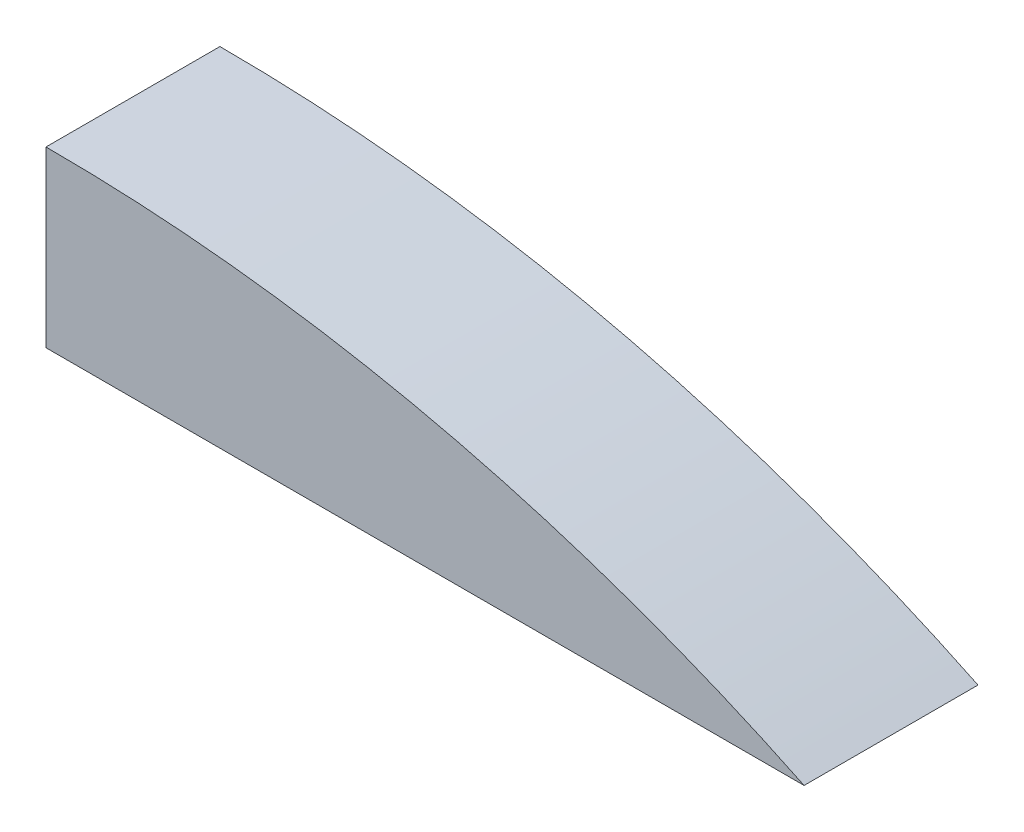
ISO-10303-21;
HEADER;
FILE_DESCRIPTION(('STEP AP214'),'2;1');
FILE_NAME('part.step','',(''),(''),'','','');
FILE_SCHEMA(('AUTOMOTIVE_DESIGN { 1 0 10303 214 1 1 1 1 }'));
ENDSEC;
DATA;
#1=APPLICATION_CONTEXT('core data for automotive mechanical design processes');
#2=APPLICATION_PROTOCOL_DEFINITION('international standard','automotive_design',2000,#1);
#3=PRODUCT_CONTEXT('',#1,'mechanical');
#4=PRODUCT('Part','Part','',(#3));
#5=PRODUCT_RELATED_PRODUCT_CATEGORY('part','',(#4));
#6=PRODUCT_DEFINITION_FORMATION('','',#4);
#7=PRODUCT_DEFINITION_CONTEXT('part definition',#1,'design');
#8=PRODUCT_DEFINITION('design','',#6,#7);
#9=PRODUCT_DEFINITION_SHAPE('','',#8);
#10=(LENGTH_UNIT() NAMED_UNIT(*) SI_UNIT(.MILLI.,.METRE.));
#11=(NAMED_UNIT(*) PLANE_ANGLE_UNIT() SI_UNIT($,.RADIAN.));
#12=(NAMED_UNIT(*) SI_UNIT($,.STERADIAN.) SOLID_ANGLE_UNIT());
#13=UNCERTAINTY_MEASURE_WITH_UNIT(LENGTH_MEASURE(1.E-05),#10,'distance_accuracy_value','');
#14=(GEOMETRIC_REPRESENTATION_CONTEXT(3) GLOBAL_UNCERTAINTY_ASSIGNED_CONTEXT((#13)) GLOBAL_UNIT_ASSIGNED_CONTEXT((#10,
#11,#12)) REPRESENTATION_CONTEXT('',''));
#15=CARTESIAN_POINT('',(0.,0.,0.));
#16=DIRECTION('',(0.,0.,1.));
#17=DIRECTION('',(1.,0.,0.));
#18=AXIS2_PLACEMENT_3D('',#15,#16,#17);
#19=CARTESIAN_POINT('',(0.,45.,0.));
#20=DIRECTION('',(0.,-1.,0.));
#21=DIRECTION('',(0.,0.,-1.));
#22=AXIS2_PLACEMENT_3D('',#19,#20,#21);
#23=PLANE('',#22);
#24=DIRECTION('',(0.,0.,-1.));
#25=VECTOR('',#24,1.);
#26=CARTESIAN_POINT('',(597.266258042068,45.,0.));
#27=LINE('',#26,#25);
#28=CARTESIAN_POINT('',(597.266258042068,45.,5.));
#29=VERTEX_POINT('',#28);
#30=CARTESIAN_POINT('',(597.266258042068,45.,0.));
#31=VERTEX_POINT('',#30);
#32=EDGE_CURVE('E74',#29,#31,#27,.T.);
#33=ORIENTED_EDGE('',*,*,#32,.T.);
#34=DIRECTION('',(1.,0.,0.));
#35=VECTOR('',#34,1.);
#36=CARTESIAN_POINT('',(-502.733741957931,45.,0.));
#37=LINE('',#36,#35);
#38=CARTESIAN_POINT('',(619.060752759772,45.,0.));
#39=VERTEX_POINT('',#38);
#40=EDGE_CURVE('E79',#31,#39,#37,.T.);
#41=ORIENTED_EDGE('',*,*,#40,.T.);
#42=DIRECTION('',(0.,0.,-1.));
#43=VECTOR('',#42,1.);
#44=CARTESIAN_POINT('',(619.060752759772,45.,80.));
#45=LINE('',#44,#43);
#46=CARTESIAN_POINT('',(619.060752759772,45.,5.));
#47=VERTEX_POINT('',#46);
#48=EDGE_CURVE('E83',#39,#47,#45,.F.);
#49=ORIENTED_EDGE('',*,*,#48,.T.);
#50=DIRECTION('',(1.,0.,0.));
#51=VECTOR('',#50,1.);
#52=CARTESIAN_POINT('',(597.266258042068,45.,5.));
#53=LINE('',#52,#51);
#54=EDGE_CURVE('E38',#29,#47,#53,.T.);
#55=ORIENTED_EDGE('',*,*,#54,.F.);
#56=EDGE_LOOP('',(#33,#41,#49,#55));
#57=FACE_BOUND('',#56,.T.);
#58=ADVANCED_FACE('F34',(#57),#23,.T.);
#59=CARTESIAN_POINT('',(-502.733741957931,0.,0.));
#60=DIRECTION('',(0.,0.,1.));
#61=DIRECTION('',(1.,0.,0.));
#62=AXIS2_PLACEMENT_3D('',#59,#60,#61);
#63=PLANE('',#62);
#64=ORIENTED_EDGE('',*,*,#40,.F.);
#65=DIRECTION('',(0.,-1.,0.));
#66=VECTOR('',#65,1.);
#67=CARTESIAN_POINT('',(597.266258042068,0.,0.));
#68=LINE('',#67,#66);
#69=CARTESIAN_POINT('',(597.266258042068,50.,0.));
#70=VERTEX_POINT('',#69);
#71=EDGE_CURVE('E43',#70,#31,#68,.T.);
#72=ORIENTED_EDGE('',*,*,#71,.F.);
#73=CARTESIAN_POINT('',(597.266258042068,0.,0.));
#74=DIRECTION('',(0.,0.,1.));
#75=DIRECTION('',(1.,0.,0.));
#76=AXIS2_PLACEMENT_3D('',#73,#74,#75);
#77=CIRCLE('',#76,50.);
#78=EDGE_CURVE('E59',#39,#70,#77,.T.);
#79=ORIENTED_EDGE('',*,*,#78,.F.);
#80=EDGE_LOOP('',(#64,#72,#79));
#81=FACE_BOUND('',#80,.T.);
#82=ADVANCED_FACE('F80',(#81),#63,.F.);
#83=CARTESIAN_POINT('',(597.266258042068,0.,80.));
#84=DIRECTION('',(0.,0.,-1.));
#85=DIRECTION('',(-1.,0.,0.));
#86=AXIS2_PLACEMENT_3D('',#83,#84,#85);
#87=CYLINDRICAL_SURFACE('',#86,50.);
#88=ORIENTED_EDGE('',*,*,#48,.F.);
#89=ORIENTED_EDGE('',*,*,#78,.T.);
#90=DIRECTION('',(0.,0.,-1.));
#91=VECTOR('',#90,1.);
#92=CARTESIAN_POINT('',(597.266258042068,50.,80.));
#93=LINE('',#92,#91);
#94=CARTESIAN_POINT('',(597.266258042068,50.,5.));
#95=VERTEX_POINT('',#94);
#96=EDGE_CURVE('E11',#95,#70,#93,.T.);
#97=ORIENTED_EDGE('',*,*,#96,.F.);
#98=CARTESIAN_POINT('',(597.266258042068,0.,5.));
#99=DIRECTION('',(0.,0.,1.));
#100=DIRECTION('',(1.,0.,0.));
#101=AXIS2_PLACEMENT_3D('',#98,#99,#100);
#102=CIRCLE('',#101,50.);
#103=EDGE_CURVE('E51',#47,#95,#102,.T.);
#104=ORIENTED_EDGE('',*,*,#103,.F.);
#105=EDGE_LOOP('',(#88,#89,#97,#104));
#106=FACE_BOUND('',#105,.T.);
#107=ADVANCED_FACE('F90',(#106),#87,.T.);
#108=CARTESIAN_POINT('',(597.266258042068,-45.,5.));
#109=DIRECTION('',(0.,0.,1.));
#110=DIRECTION('',(1.,0.,0.));
#111=AXIS2_PLACEMENT_3D('',#108,#109,#110);
#112=PLANE('',#111);
#113=DIRECTION('',(0.,-1.,0.));
#114=VECTOR('',#113,1.);
#115=CARTESIAN_POINT('',(597.266258042068,-45.,5.));
#116=LINE('',#115,#114);
#117=EDGE_CURVE('E76',#95,#29,#116,.T.);
#118=ORIENTED_EDGE('',*,*,#117,.T.);
#119=ORIENTED_EDGE('',*,*,#54,.T.);
#120=ORIENTED_EDGE('',*,*,#103,.T.);
#121=EDGE_LOOP('',(#118,#119,#120));
#122=FACE_BOUND('',#121,.T.);
#123=ADVANCED_FACE('F36',(#122),#112,.T.);
#124=CARTESIAN_POINT('',(597.266258042068,0.,0.));
#125=DIRECTION('',(-1.,0.,0.));
#126=DIRECTION('',(0.,0.,1.));
#127=AXIS2_PLACEMENT_3D('',#124,#125,#126);
#128=PLANE('',#127);
#129=ORIENTED_EDGE('',*,*,#96,.T.);
#130=ORIENTED_EDGE('',*,*,#71,.T.);
#131=ORIENTED_EDGE('',*,*,#32,.F.);
#132=ORIENTED_EDGE('',*,*,#117,.F.);
#133=EDGE_LOOP('',(#129,#130,#131,#132));
#134=FACE_BOUND('',#133,.T.);
#135=ADVANCED_FACE('F72',(#134),#128,.T.);
#136=CLOSED_SHELL('',(#58,#82,#107,#123,#135));
#137=MANIFOLD_SOLID_BREP('B2',#136);
#138=ADVANCED_BREP_SHAPE_REPRESENTATION('',(#18,#137),#14);
#139=SHAPE_DEFINITION_REPRESENTATION(#9,#138);
ENDSEC;
END-ISO-10303-21;
